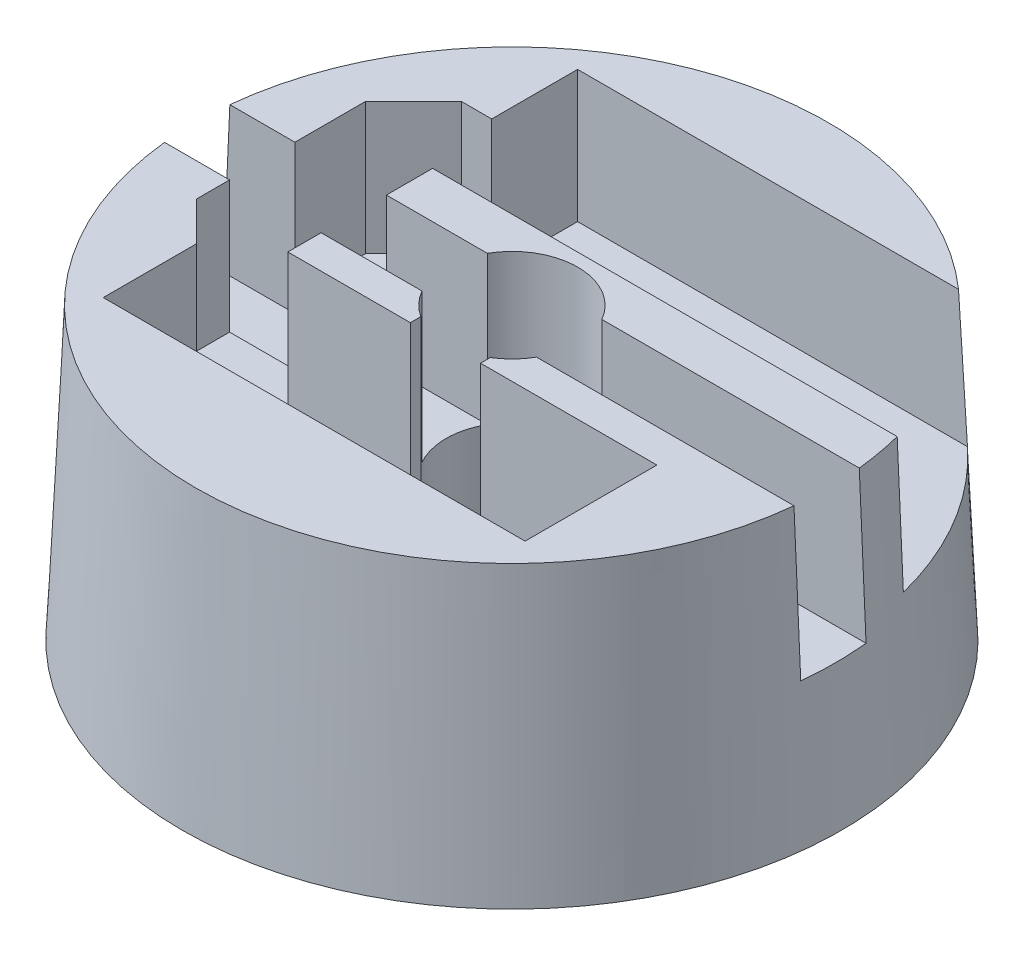
ISO-10303-21;
HEADER;
FILE_DESCRIPTION(('STEP AP214'),'2;1');
FILE_NAME('part.step','',(''),(''),'','','');
FILE_SCHEMA(('AUTOMOTIVE_DESIGN { 1 0 10303 214 1 1 1 1 }'));
ENDSEC;
DATA;
#1=APPLICATION_CONTEXT('core data for automotive mechanical design processes');
#2=APPLICATION_PROTOCOL_DEFINITION('international standard','automotive_design',2000,#1);
#3=PRODUCT_CONTEXT('',#1,'mechanical');
#4=PRODUCT('Part','Part','',(#3));
#5=PRODUCT_RELATED_PRODUCT_CATEGORY('part','',(#4));
#6=PRODUCT_DEFINITION_FORMATION('','',#4);
#7=PRODUCT_DEFINITION_CONTEXT('part definition',#1,'design');
#8=PRODUCT_DEFINITION('design','',#6,#7);
#9=PRODUCT_DEFINITION_SHAPE('','',#8);
#10=(LENGTH_UNIT() NAMED_UNIT(*) SI_UNIT(.MILLI.,.METRE.));
#11=(NAMED_UNIT(*) PLANE_ANGLE_UNIT() SI_UNIT($,.RADIAN.));
#12=(NAMED_UNIT(*) SI_UNIT($,.STERADIAN.) SOLID_ANGLE_UNIT());
#13=UNCERTAINTY_MEASURE_WITH_UNIT(LENGTH_MEASURE(1.E-05),#10,'distance_accuracy_value','');
#14=(GEOMETRIC_REPRESENTATION_CONTEXT(3) GLOBAL_UNCERTAINTY_ASSIGNED_CONTEXT((#13)) GLOBAL_UNIT_ASSIGNED_CONTEXT((#10,
#11,#12)) REPRESENTATION_CONTEXT('',''));
#15=CARTESIAN_POINT('',(0.,0.,0.));
#16=DIRECTION('',(0.,0.,1.));
#17=DIRECTION('',(1.,0.,0.));
#18=AXIS2_PLACEMENT_3D('',#15,#16,#17);
#19=CARTESIAN_POINT('',(0.,11.,0.));
#20=DIRECTION('',(0.,1.,0.));
#21=DIRECTION('',(0.,0.,1.));
#22=AXIS2_PLACEMENT_3D('',#19,#20,#21);
#23=PLANE('',#22);
#24=DIRECTION('',(0.,0.,-1.));
#25=VECTOR('',#24,1.);
#26=CARTESIAN_POINT('',(-5.99819685805333,11.,-2.99103256238981));
#27=LINE('',#26,#25);
#28=CARTESIAN_POINT('',(-5.99819685805333,11.,2.5));
#29=VERTEX_POINT('',#28);
#30=CARTESIAN_POINT('',(-5.99819685805333,11.,1.23834620696073));
#31=VERTEX_POINT('',#30);
#32=EDGE_CURVE('E257',#29,#31,#27,.T.);
#33=ORIENTED_EDGE('',*,*,#32,.F.);
#34=DIRECTION('',(1.,0.,0.));
#35=VECTOR('',#34,1.);
#36=CARTESIAN_POINT('',(0.,11.,2.5));
#37=LINE('',#36,#35);
#38=CARTESIAN_POINT('',(-1.35227256614182,11.,2.5));
#39=VERTEX_POINT('',#38);
#40=EDGE_CURVE('E487',#29,#39,#37,.T.);
#41=ORIENTED_EDGE('',*,*,#40,.T.);
#42=DIRECTION('',(0.,0.,1.));
#43=VECTOR('',#42,1.);
#44=CARTESIAN_POINT('',(-1.35227256614182,11.,0.));
#45=LINE('',#44,#43);
#46=CARTESIAN_POINT('',(-1.35227256614182,11.,2.10270276236567));
#47=VERTEX_POINT('',#46);
#48=EDGE_CURVE('E490',#47,#39,#45,.T.);
#49=ORIENTED_EDGE('',*,*,#48,.F.);
#50=CARTESIAN_POINT('',(0.,11.,0.));
#51=DIRECTION('',(0.,1.,0.));
#52=DIRECTION('',(0.,0.,1.));
#53=AXIS2_PLACEMENT_3D('',#50,#51,#52);
#54=CIRCLE('',#53,2.5);
#55=CARTESIAN_POINT('',(-2.17175014025693,11.,1.23834620696073));
#56=VERTEX_POINT('',#55);
#57=EDGE_CURVE('E499',#47,#56,#54,.F.);
#58=ORIENTED_EDGE('',*,*,#57,.T.);
#59=DIRECTION('',(1.,0.,0.));
#60=VECTOR('',#59,1.);
#61=CARTESIAN_POINT('',(0.,11.,1.23834620696073));
#62=LINE('',#61,#60);
#63=EDGE_CURVE('E544',#31,#56,#62,.T.);
#64=ORIENTED_EDGE('',*,*,#63,.F.);
#65=EDGE_LOOP('',(#33,#41,#49,#58,#64));
#66=FACE_BOUND('',#65,.T.);
#67=ADVANCED_FACE('F43',(#66),#23,.T.);
#68=CARTESIAN_POINT('',(-5.99819685805333,11.,-1.23834620696073));
#69=VERTEX_POINT('',#68);
#70=CARTESIAN_POINT('',(-5.99819685805333,11.,-2.99103256238981));
#71=VERTEX_POINT('',#70);
#72=EDGE_CURVE('E638',#69,#71,#27,.T.);
#73=ORIENTED_EDGE('',*,*,#72,.F.);
#74=DIRECTION('',(-1.,0.,0.));
#75=VECTOR('',#74,1.);
#76=CARTESIAN_POINT('',(0.,11.,-1.23834620696073));
#77=LINE('',#76,#75);
#78=CARTESIAN_POINT('',(-2.17175014025693,11.,-1.23834620696073));
#79=VERTEX_POINT('',#78);
#80=EDGE_CURVE('E566',#79,#69,#77,.T.);
#81=ORIENTED_EDGE('',*,*,#80,.F.);
#82=CARTESIAN_POINT('',(2.17175014025693,11.,-1.23834620696073));
#83=VERTEX_POINT('',#82);
#84=EDGE_CURVE('E497',#79,#83,#54,.F.);
#85=ORIENTED_EDGE('',*,*,#84,.T.);
#86=CARTESIAN_POINT('',(11.9359351916848,11.,-1.23834620696073));
#87=VERTEX_POINT('',#86);
#88=EDGE_CURVE('E557',#87,#83,#77,.T.);
#89=ORIENTED_EDGE('',*,*,#88,.F.);
#90=CARTESIAN_POINT('',(0.,11.,0.));
#91=DIRECTION('',(0.,1.,0.));
#92=DIRECTION('',(0.,0.,1.));
#93=AXIS2_PLACEMENT_3D('',#90,#91,#92);
#94=CIRCLE('',#93,12.);
#95=CARTESIAN_POINT('',(11.6212617305835,11.,-2.99103256238982));
#96=VERTEX_POINT('',#95);
#97=EDGE_CURVE('E353',#87,#96,#94,.T.);
#98=ORIENTED_EDGE('',*,*,#97,.T.);
#99=DIRECTION('',(-1.,0.,0.));
#100=VECTOR('',#99,1.);
#101=CARTESIAN_POINT('',(0.,11.,-2.99103256238981));
#102=LINE('',#101,#100);
#103=EDGE_CURVE('E274',#96,#71,#102,.T.);
#104=ORIENTED_EDGE('',*,*,#103,.T.);
#105=EDGE_LOOP('',(#73,#81,#85,#89,#98,#104));
#106=FACE_BOUND('',#105,.T.);
#107=ADVANCED_FACE('F676',(#106),#23,.T.);
#108=DIRECTION('',(0.707106781186557,0.,0.707106781186538));
#109=VECTOR('',#108,1.);
#110=CARTESIAN_POINT('',(-8.,11.,3.96939497959408));
#111=LINE('',#110,#109);
#112=CARTESIAN_POINT('',(-9.46939497959411,11.,2.5));
#113=VERTEX_POINT('',#112);
#114=CARTESIAN_POINT('',(-8.,11.,3.96939497959408));
#115=VERTEX_POINT('',#114);
#116=EDGE_CURVE('E641',#113,#115,#111,.T.);
#117=ORIENTED_EDGE('',*,*,#116,.F.);
#118=DIRECTION('',(0.,0.,1.));
#119=VECTOR('',#118,1.);
#120=CARTESIAN_POINT('',(-9.46939497959411,11.,2.5));
#121=LINE('',#120,#119);
#122=CARTESIAN_POINT('',(-9.46939497959411,11.,1.23834620696073));
#123=VERTEX_POINT('',#122);
#124=EDGE_CURVE('E647',#123,#113,#121,.T.);
#125=ORIENTED_EDGE('',*,*,#124,.F.);
#126=CARTESIAN_POINT('',(-11.9359351916849,11.,1.23834620696073));
#127=VERTEX_POINT('',#126);
#128=EDGE_CURVE('E282',#127,#123,#62,.T.);
#129=ORIENTED_EDGE('',*,*,#128,.F.);
#130=CARTESIAN_POINT('',(11.9359311362898,11.,1.23834620696073));
#131=VERTEX_POINT('',#130);
#132=EDGE_CURVE('E462',#127,#131,#94,.T.);
#133=ORIENTED_EDGE('',*,*,#132,.T.);
#134=CARTESIAN_POINT('',(2.17175014025693,11.,1.23834620696073));
#135=VERTEX_POINT('',#134);
#136=EDGE_CURVE('E548',#135,#131,#62,.T.);
#137=ORIENTED_EDGE('',*,*,#136,.F.);
#138=CARTESIAN_POINT('',(1.30993148311024,11.,2.12933781010826));
#139=VERTEX_POINT('',#138);
#140=EDGE_CURVE('E494',#135,#139,#54,.F.);
#141=ORIENTED_EDGE('',*,*,#140,.T.);
#142=DIRECTION('',(0.,0.,1.));
#143=VECTOR('',#142,1.);
#144=CARTESIAN_POINT('',(1.30993148311024,11.,0.));
#145=LINE('',#144,#143);
#146=CARTESIAN_POINT('',(1.30993148311024,11.,2.5));
#147=VERTEX_POINT('',#146);
#148=EDGE_CURVE('E504',#139,#147,#145,.T.);
#149=ORIENTED_EDGE('',*,*,#148,.T.);
#150=DIRECTION('',(1.,0.,0.));
#151=VECTOR('',#150,1.);
#152=CARTESIAN_POINT('',(0.,11.,2.5));
#153=LINE('',#152,#151);
#154=CARTESIAN_POINT('',(8.,11.,2.5));
#155=VERTEX_POINT('',#154);
#156=EDGE_CURVE('E473',#147,#155,#153,.T.);
#157=ORIENTED_EDGE('',*,*,#156,.T.);
#158=DIRECTION('',(0.,0.,1.));
#159=VECTOR('',#158,1.);
#160=CARTESIAN_POINT('',(8.,11.,0.));
#161=LINE('',#160,#159);
#162=CARTESIAN_POINT('',(8.,11.,7.5));
#163=VERTEX_POINT('',#162);
#164=EDGE_CURVE('E477',#155,#163,#161,.T.);
#165=ORIENTED_EDGE('',*,*,#164,.T.);
#166=DIRECTION('',(1.,0.,0.));
#167=VECTOR('',#166,1.);
#168=CARTESIAN_POINT('',(0.,11.,7.5));
#169=LINE('',#168,#167);
#170=CARTESIAN_POINT('',(-8.,11.,7.5));
#171=VERTEX_POINT('',#170);
#172=EDGE_CURVE('E481',#171,#163,#169,.T.);
#173=ORIENTED_EDGE('',*,*,#172,.F.);
#174=DIRECTION('',(0.,0.,1.));
#175=VECTOR('',#174,1.);
#176=CARTESIAN_POINT('',(-8.,11.,0.));
#177=LINE('',#176,#175);
#178=EDGE_CURVE('E484',#115,#171,#177,.T.);
#179=ORIENTED_EDGE('',*,*,#178,.F.);
#180=EDGE_LOOP('',(#117,#125,#129,#133,#137,#141,#149,#157,#165,#173,#179));
#181=FACE_BOUND('',#180,.T.);
#182=ADVANCED_FACE('F698',(#181),#23,.T.);
#183=CARTESIAN_POINT('',(0.,0.,0.));
#184=DIRECTION('',(0.,1.,0.));
#185=DIRECTION('',(0.,0.,1.));
#186=AXIS2_PLACEMENT_3D('',#183,#184,#185);
#187=PLANE('',#186);
#188=CARTESIAN_POINT('',(0.,0.,0.));
#189=DIRECTION('',(0.,1.,0.));
#190=DIRECTION('',(0.,0.,1.));
#191=AXIS2_PLACEMENT_3D('',#188,#189,#190);
#192=CIRCLE('',#191,12.5);
#193=CARTESIAN_POINT('',(0.,0.,12.5));
#194=VERTEX_POINT('',#193);
#195=EDGE_CURVE('E470',#194,#194,#192,.T.);
#196=ORIENTED_EDGE('',*,*,#195,.F.);
#197=EDGE_LOOP('',(#196));
#198=FACE_BOUND('',#197,.T.);
#199=DIRECTION('',(0.,0.,-1.));
#200=VECTOR('',#199,1.);
#201=CARTESIAN_POINT('',(1.30993148311024,0.,2.5));
#202=LINE('',#201,#200);
#203=CARTESIAN_POINT('',(1.30993148311024,0.,2.5));
#204=VERTEX_POINT('',#203);
#205=CARTESIAN_POINT('',(1.30993148311024,0.,2.12933781010826));
#206=VERTEX_POINT('',#205);
#207=EDGE_CURVE('E296',#204,#206,#202,.T.);
#208=ORIENTED_EDGE('',*,*,#207,.T.);
#209=CARTESIAN_POINT('',(0.,0.,0.));
#210=DIRECTION('',(0.,1.,0.));
#211=DIRECTION('',(0.,0.,1.));
#212=AXIS2_PLACEMENT_3D('',#209,#210,#211);
#213=CIRCLE('',#212,2.5);
#214=CARTESIAN_POINT('',(-1.35227256614182,0.,2.10270276236567));
#215=VERTEX_POINT('',#214);
#216=EDGE_CURVE('E300',#206,#215,#213,.T.);
#217=ORIENTED_EDGE('',*,*,#216,.T.);
#218=DIRECTION('',(0.,0.,-1.));
#219=VECTOR('',#218,1.);
#220=CARTESIAN_POINT('',(-1.35227256614182,0.,2.5));
#221=LINE('',#220,#219);
#222=CARTESIAN_POINT('',(-1.35227256614182,0.,2.5));
#223=VERTEX_POINT('',#222);
#224=EDGE_CURVE('E304',#223,#215,#221,.T.);
#225=ORIENTED_EDGE('',*,*,#224,.F.);
#226=DIRECTION('',(-1.,0.,0.));
#227=VECTOR('',#226,1.);
#228=CARTESIAN_POINT('',(-1.35227256614182,0.,2.5));
#229=LINE('',#228,#227);
#230=CARTESIAN_POINT('',(-8.,0.,2.5));
#231=VERTEX_POINT('',#230);
#232=EDGE_CURVE('E308',#223,#231,#229,.T.);
#233=ORIENTED_EDGE('',*,*,#232,.T.);
#234=DIRECTION('',(0.,0.,-1.));
#235=VECTOR('',#234,1.);
#236=CARTESIAN_POINT('',(-8.,0.,7.5));
#237=LINE('',#236,#235);
#238=CARTESIAN_POINT('',(-8.,0.,7.5));
#239=VERTEX_POINT('',#238);
#240=EDGE_CURVE('E312',#239,#231,#237,.T.);
#241=ORIENTED_EDGE('',*,*,#240,.F.);
#242=DIRECTION('',(-1.,0.,0.));
#243=VECTOR('',#242,1.);
#244=CARTESIAN_POINT('',(8.,0.,7.5));
#245=LINE('',#244,#243);
#246=CARTESIAN_POINT('',(8.,0.,7.5));
#247=VERTEX_POINT('',#246);
#248=EDGE_CURVE('E316',#247,#239,#245,.T.);
#249=ORIENTED_EDGE('',*,*,#248,.F.);
#250=DIRECTION('',(0.,0.,-1.));
#251=VECTOR('',#250,1.);
#252=CARTESIAN_POINT('',(8.,0.,7.5));
#253=LINE('',#252,#251);
#254=CARTESIAN_POINT('',(8.,0.,2.5));
#255=VERTEX_POINT('',#254);
#256=EDGE_CURVE('E320',#247,#255,#253,.T.);
#257=ORIENTED_EDGE('',*,*,#256,.T.);
#258=DIRECTION('',(-1.,0.,0.));
#259=VECTOR('',#258,1.);
#260=CARTESIAN_POINT('',(8.,0.,2.5));
#261=LINE('',#260,#259);
#262=EDGE_CURVE('E324',#255,#204,#261,.T.);
#263=ORIENTED_EDGE('',*,*,#262,.T.);
#264=EDGE_LOOP('',(#208,#217,#225,#233,#241,#249,#257,#263));
#265=FACE_BOUND('',#264,.T.);
#266=ADVANCED_FACE('F45',(#198,#265),#187,.F.);
#267=CARTESIAN_POINT('',(-9.46939497959411,11.,-3.91058912804461));
#268=VERTEX_POINT('',#267);
#269=CARTESIAN_POINT('',(-9.46939497959411,11.,-1.23834620696073));
#270=VERTEX_POINT('',#269);
#271=EDGE_CURVE('E644',#268,#270,#121,.T.);
#272=ORIENTED_EDGE('',*,*,#271,.F.);
#273=DIRECTION('',(-0.707106781186538,0.,0.707106781186557));
#274=VECTOR('',#273,1.);
#275=CARTESIAN_POINT('',(-9.46939497959411,11.,-3.91058912804461));
#276=LINE('',#275,#274);
#277=CARTESIAN_POINT('',(-7.64558714149943,11.,-5.73439696613935));
#278=VERTEX_POINT('',#277);
#279=EDGE_CURVE('E266',#278,#268,#276,.T.);
#280=ORIENTED_EDGE('',*,*,#279,.F.);
#281=DIRECTION('',(-1.,0.,0.));
#282=VECTOR('',#281,1.);
#283=CARTESIAN_POINT('',(-7.64558714149943,11.,-5.73439696613935));
#284=LINE('',#283,#282);
#285=CARTESIAN_POINT('',(-6.5,11.,-5.73439696613935));
#286=VERTEX_POINT('',#285);
#287=EDGE_CURVE('E248',#286,#278,#284,.T.);
#288=ORIENTED_EDGE('',*,*,#287,.F.);
#289=DIRECTION('',(0.,0.,-1.));
#290=VECTOR('',#289,1.);
#291=CARTESIAN_POINT('',(-6.5,11.,0.));
#292=LINE('',#291,#290);
#293=CARTESIAN_POINT('',(-6.5,11.,-8.99103256238981));
#294=VERTEX_POINT('',#293);
#295=EDGE_CURVE('E263',#286,#294,#292,.T.);
#296=ORIENTED_EDGE('',*,*,#295,.T.);
#297=DIRECTION('',(-1.,0.,0.));
#298=VECTOR('',#297,1.);
#299=CARTESIAN_POINT('',(0.,11.,-8.99103256238981));
#300=LINE('',#299,#298);
#301=CARTESIAN_POINT('',(7.94741048782848,11.,-8.99103256238982));
#302=VERTEX_POINT('',#301);
#303=EDGE_CURVE('E280',#302,#294,#300,.T.);
#304=ORIENTED_EDGE('',*,*,#303,.F.);
#305=CARTESIAN_POINT('',(-11.9359311362898,11.,-1.23834620696073));
#306=VERTEX_POINT('',#305);
#307=EDGE_CURVE('E466',#302,#306,#94,.T.);
#308=ORIENTED_EDGE('',*,*,#307,.T.);
#309=EDGE_CURVE('E48',#270,#306,#77,.T.);
#310=ORIENTED_EDGE('',*,*,#309,.F.);
#311=EDGE_LOOP('',(#272,#280,#288,#296,#304,#308,#310));
#312=FACE_BOUND('',#311,.T.);
#313=ADVANCED_FACE('F261',(#312),#23,.T.);
#314=CARTESIAN_POINT('',(0.,11.,0.));
#315=DIRECTION('',(0.,-1.,0.));
#316=DIRECTION('',(0.,0.,-1.));
#317=AXIS2_PLACEMENT_3D('',#314,#315,#316);
#318=CONICAL_SURFACE('',#317,12.,0.0454232794215769);
#319=CARTESIAN_POINT('',(-13.117029772466,-14.8578033242267,1.23834620696073));
#320=CARTESIAN_POINT('',(-12.7644742884908,-7.13534234058265,1.23834620696073));
#321=CARTESIAN_POINT('',(-12.4117562562751,0.587111215347854,1.23834620696073));
#322=CARTESIAN_POINT('',(-11.7059950953354,16.0320034723826,1.23834620696073));
#323=CARTESIAN_POINT('',(-11.3529519666113,23.7544421734868,1.23834620696073));
#324=CARTESIAN_POINT('',(-10.9997462896468,31.4768734468775,1.23834620696073));
#325=B_SPLINE_CURVE_WITH_KNOTS('',3,(#319,#320,#321,#322,#323,#324),.UNSPECIFIED.,.F.,.F.,(4,2,
4),(0.,23.1915133271588,46.3830266561217),.UNSPECIFIED.);
#326=CARTESIAN_POINT('',(-12.193052592803,5.37293922191145,1.23834620696073));
#327=VERTEX_POINT('',#326);
#328=EDGE_CURVE('E275',#327,#127,#325,.T.);
#329=ORIENTED_EDGE('',*,*,#328,.F.);
#330=CARTESIAN_POINT('',(0.,5.37293922191145,0.));
#331=DIRECTION('',(0.,-1.,0.));
#332=DIRECTION('',(0.,0.,-1.));
#333=AXIS2_PLACEMENT_3D('',#330,#331,#332);
#334=CIRCLE('',#333,12.2557754899131);
#335=CARTESIAN_POINT('',(-12.193052592803,5.37293922191145,-1.23834620696073));
#336=VERTEX_POINT('',#335);
#337=EDGE_CURVE('E580',#336,#327,#334,.F.);
#338=ORIENTED_EDGE('',*,*,#337,.F.);
#339=CARTESIAN_POINT('',(-10.9997462896468,31.4768734468775,-1.23834620696073));
#340=CARTESIAN_POINT('',(-11.3529519666113,23.7544421734868,-1.23834620696073));
#341=CARTESIAN_POINT('',(-11.7059950953354,16.0320034723826,-1.23834620696073));
#342=CARTESIAN_POINT('',(-12.4117562562751,0.587111215347852,-1.23834620696073));
#343=CARTESIAN_POINT('',(-12.7644742884908,-7.13534234058266,-1.23834620696073));
#344=CARTESIAN_POINT('',(-13.117029772466,-14.8578033242267,-1.23834620696073));
#345=B_SPLINE_CURVE_WITH_KNOTS('',3,(#339,#340,#341,#342,#343,#344),.UNSPECIFIED.,.F.,.F.,(4,2,
4),(0.,23.1915133289628,46.3830266561217),.UNSPECIFIED.);
#346=EDGE_CURVE('E563',#306,#336,#345,.T.);
#347=ORIENTED_EDGE('',*,*,#346,.F.);
#348=ORIENTED_EDGE('',*,*,#307,.F.);
#349=CARTESIAN_POINT('',(9.62456027674111,-14.7583135931586,-8.99103256238982));
#350=CARTESIAN_POINT('',(9.50460311291744,-12.8298920917526,-8.99103256238982));
#351=CARTESIAN_POINT('',(9.38361471344495,-10.9015350060955,-8.99103256238982));
#352=CARTESIAN_POINT('',(9.13929785485715,-7.04496844380558,-8.99103256238982));
#353=CARTESIAN_POINT('',(9.0159693949052,-5.11675896722578,-8.99103256238982));
#354=CARTESIAN_POINT('',(8.64206128999401,0.66756183088233,-8.99103256238982));
#355=CARTESIAN_POINT('',(8.38755545312266,4.52342151389375,-8.99103256238982));
#356=CARTESIAN_POINT('',(7.99550974336136,10.3065291788593,-8.99103256238982));
#357=CARTESIAN_POINT('',(7.86311276847584,12.2341262068182,-8.99103256238982));
#358=CARTESIAN_POINT('',(7.59431080439872,16.0890398542785,-8.99103256238982));
#359=CARTESIAN_POINT('',(7.45790581810993,18.0163564739822,-8.99103256238982));
#360=CARTESIAN_POINT('',(7.18040413035396,21.8706799581701,-8.99103256238982));
#361=CARTESIAN_POINT('',(7.03930736354176,23.7976868179642,-8.99103256238982));
#362=CARTESIAN_POINT('',(6.75144536837912,27.6512815916487,-8.99103256238982));
#363=CARTESIAN_POINT('',(6.60468012549323,29.577869504452,-8.99103256238982));
#364=CARTESIAN_POINT('',(6.45459172817763,31.5042018369519,-8.99103256238982));
#365=B_SPLINE_CURVE_WITH_KNOTS('',3,(#349,#350,#351,#352,#353,#354,#355,#356,#357,#358,#359,
#360,#361,#362,#363,#364),.UNSPECIFIED.,.F.,.F.,(4,2,2,2,2,2,2,4),(0.,5.79644557675369,
11.5928932258963,23.1856202235854,28.9820325433494,34.7784406651606,40.5749295505959,
46.3714333007276),.UNSPECIFIED.);
#366=CARTESIAN_POINT('',(8.28658746464149,6.,-8.99103256238982));
#367=VERTEX_POINT('',#366);
#368=EDGE_CURVE('E515',#367,#302,#365,.T.);
#369=ORIENTED_EDGE('',*,*,#368,.F.);
#370=CARTESIAN_POINT('',(0.,6.,0.));
#371=DIRECTION('',(0.,1.,0.));
#372=DIRECTION('',(0.,0.,1.));
#373=AXIS2_PLACEMENT_3D('',#370,#371,#372);
#374=CIRCLE('',#373,12.2272727272727);
#375=CARTESIAN_POINT('',(11.8557970022193,6.,-2.99103256238982));
#376=VERTEX_POINT('',#375);
#377=EDGE_CURVE('E507',#367,#376,#374,.F.);
#378=ORIENTED_EDGE('',*,*,#377,.T.);
#379=CARTESIAN_POINT('',(12.81776976363,-14.5667190671401,-2.99103256238982));
#380=CARTESIAN_POINT('',(12.6377312094468,-10.7095320178803,-2.99103256238982));
#381=CARTESIAN_POINT('',(12.4575004855776,-6.85235393167699,-2.99103256238982));
#382=CARTESIAN_POINT('',(12.0965933018263,0.861981317465294,-2.99103256238982));
#383=CARTESIAN_POINT('',(11.9159168419521,4.71913848040464,-2.99103256238982));
#384=CARTESIAN_POINT('',(11.5540567823311,12.4334290405398,-2.99103256238982));
#385=CARTESIAN_POINT('',(11.3728731825819,16.2905624377355,-2.99103256238982));
#386=CARTESIAN_POINT('',(11.0099173026102,24.0048016014442,-2.99103256238982));
#387=CARTESIAN_POINT('',(10.8281450223771,27.8619073679565,-2.99103256238982));
#388=CARTESIAN_POINT('',(10.6460376344222,31.7189973266309,-2.99103256238982));
#389=B_SPLINE_CURVE_WITH_KNOTS('',3,(#379,#380,#381,#382,#383,#384,#385,#386,#387,#388),
.UNSPECIFIED.,.F.,.F.,(4,2,2,2,4),(0.,11.5841595480429,23.1683188899669,34.7524782841745,
46.3366378848027),.UNSPECIFIED.);
#390=EDGE_CURVE('E511',#376,#96,#389,.T.);
#391=ORIENTED_EDGE('',*,*,#390,.T.);
#392=ORIENTED_EDGE('',*,*,#97,.F.);
#393=CARTESIAN_POINT('',(13.117029772466,-14.8578033242267,-1.23834620696073));
#394=CARTESIAN_POINT('',(12.7644742884908,-7.13534234058265,-1.23834620696073));
#395=CARTESIAN_POINT('',(12.4117562562751,0.587111215347854,-1.23834620696073));
#396=CARTESIAN_POINT('',(11.7059950953354,16.0320034723826,-1.23834620696073));
#397=CARTESIAN_POINT('',(11.3529519666113,23.7544421734868,-1.23834620696073));
#398=CARTESIAN_POINT('',(10.9997462896468,31.4768734468775,-1.23834620696073));
#399=B_SPLINE_CURVE_WITH_KNOTS('',3,(#393,#394,#395,#396,#397,#398),.UNSPECIFIED.,.F.,.F.,(4,2,
4),(0.,23.1915133271588,46.3830266561217),.UNSPECIFIED.);
#400=CARTESIAN_POINT('',(12.193052592803,5.37293922191145,-1.23834620696073));
#401=VERTEX_POINT('',#400);
#402=EDGE_CURVE('E552',#401,#87,#399,.T.);
#403=ORIENTED_EDGE('',*,*,#402,.F.);
#404=CARTESIAN_POINT('',(12.193052592803,5.37293922191145,1.23834620696073));
#405=VERTEX_POINT('',#404);
#406=EDGE_CURVE('E584',#405,#401,#334,.F.);
#407=ORIENTED_EDGE('',*,*,#406,.F.);
#408=CARTESIAN_POINT('',(10.9997462896468,31.4768734468775,1.23834620696073));
#409=CARTESIAN_POINT('',(11.3529519666113,23.7544421734868,1.23834620696073));
#410=CARTESIAN_POINT('',(11.7059950953354,16.0320034723826,1.23834620696073));
#411=CARTESIAN_POINT('',(12.4117562562751,0.587111215347852,1.23834620696073));
#412=CARTESIAN_POINT('',(12.7644742884908,-7.13534234058266,1.23834620696073));
#413=CARTESIAN_POINT('',(13.117029772466,-14.8578033242267,1.23834620696073));
#414=B_SPLINE_CURVE_WITH_KNOTS('',3,(#408,#409,#410,#411,#412,#413),.UNSPECIFIED.,.F.,.F.,(4,2,
4),(0.,23.1915133289628,46.3830266561217),.UNSPECIFIED.);
#415=EDGE_CURVE('E429',#131,#405,#414,.T.);
#416=ORIENTED_EDGE('',*,*,#415,.F.);
#417=ORIENTED_EDGE('',*,*,#132,.F.);
#418=EDGE_LOOP('',(#329,#338,#347,#348,#369,#378,#391,#392,#403,#407,#416,#417));
#419=FACE_BOUND('',#418,.T.);
#420=ORIENTED_EDGE('',*,*,#195,.T.);
#421=EDGE_LOOP('',(#420));
#422=FACE_BOUND('',#421,.T.);
#423=ADVANCED_FACE('F362',(#419,#422),#318,.T.);
#424=CARTESIAN_POINT('',(1.30993148311024,11.0001,2.5));
#425=DIRECTION('',(-1.,0.,0.));
#426=DIRECTION('',(0.,0.,1.));
#427=AXIS2_PLACEMENT_3D('',#424,#425,#426);
#428=PLANE('',#427);
#429=DIRECTION('',(0.,-1.,0.));
#430=VECTOR('',#429,1.);
#431=CARTESIAN_POINT('',(1.30993148311024,11.0001,2.12933781010826));
#432=LINE('',#431,#430);
#433=EDGE_CURVE('E350',#139,#206,#432,.T.);
#434=ORIENTED_EDGE('',*,*,#433,.T.);
#435=ORIENTED_EDGE('',*,*,#207,.F.);
#436=DIRECTION('',(0.,-1.,0.));
#437=VECTOR('',#436,1.);
#438=CARTESIAN_POINT('',(1.30993148311024,11.0001,2.5));
#439=LINE('',#438,#437);
#440=EDGE_CURVE('E328',#147,#204,#439,.T.);
#441=ORIENTED_EDGE('',*,*,#440,.F.);
#442=ORIENTED_EDGE('',*,*,#148,.F.);
#443=EDGE_LOOP('',(#434,#435,#441,#442));
#444=FACE_BOUND('',#443,.T.);
#445=ADVANCED_FACE('F371',(#444),#428,.T.);
#446=CARTESIAN_POINT('',(0.,11.0001,0.));
#447=DIRECTION('',(0.,-1.,0.));
#448=DIRECTION('',(0.,0.,-1.));
#449=AXIS2_PLACEMENT_3D('',#446,#447,#448);
#450=CYLINDRICAL_SURFACE('',#449,2.5);
#451=DIRECTION('',(0.,-1.,0.));
#452=VECTOR('',#451,1.);
#453=CARTESIAN_POINT('',(2.17175014025693,11.0001,1.23834620696073));
#454=LINE('',#453,#452);
#455=CARTESIAN_POINT('',(2.17175014025693,5.37293922191145,1.23834620696073));
#456=VERTEX_POINT('',#455);
#457=EDGE_CURVE('E531',#456,#135,#454,.F.);
#458=ORIENTED_EDGE('',*,*,#457,.F.);
#459=CARTESIAN_POINT('',(0.,5.37293922191145,0.));
#460=DIRECTION('',(0.,-1.,0.));
#461=DIRECTION('',(0.,0.,-1.));
#462=AXIS2_PLACEMENT_3D('',#459,#460,#461);
#463=CIRCLE('',#462,2.5);
#464=CARTESIAN_POINT('',(2.17175014025693,5.37293922191145,-1.23834620696073));
#465=VERTEX_POINT('',#464);
#466=EDGE_CURVE('E520',#465,#456,#463,.T.);
#467=ORIENTED_EDGE('',*,*,#466,.F.);
#468=DIRECTION('',(0.,-1.,0.));
#469=VECTOR('',#468,1.);
#470=CARTESIAN_POINT('',(2.17175014025693,11.0001,-1.23834620696073));
#471=LINE('',#470,#469);
#472=EDGE_CURVE('E528',#83,#465,#471,.T.);
#473=ORIENTED_EDGE('',*,*,#472,.F.);
#474=ORIENTED_EDGE('',*,*,#84,.F.);
#475=DIRECTION('',(0.,-1.,0.));
#476=VECTOR('',#475,1.);
#477=CARTESIAN_POINT('',(-2.17175014025693,11.0001,-1.23834620696073));
#478=LINE('',#477,#476);
#479=CARTESIAN_POINT('',(-2.17175014025693,5.37293922191145,-1.23834620696073));
#480=VERTEX_POINT('',#479);
#481=EDGE_CURVE('E519',#480,#79,#478,.F.);
#482=ORIENTED_EDGE('',*,*,#481,.F.);
#483=CARTESIAN_POINT('',(-2.17175014025693,5.37293922191145,1.23834620696073));
#484=VERTEX_POINT('',#483);
#485=EDGE_CURVE('E517',#484,#480,#463,.T.);
#486=ORIENTED_EDGE('',*,*,#485,.F.);
#487=DIRECTION('',(0.,-1.,0.));
#488=VECTOR('',#487,1.);
#489=CARTESIAN_POINT('',(-2.17175014025693,11.0001,1.23834620696073));
#490=LINE('',#489,#488);
#491=EDGE_CURVE('E522',#56,#484,#490,.T.);
#492=ORIENTED_EDGE('',*,*,#491,.F.);
#493=ORIENTED_EDGE('',*,*,#57,.F.);
#494=DIRECTION('',(0.,-1.,0.));
#495=VECTOR('',#494,1.);
#496=CARTESIAN_POINT('',(-1.35227256614182,11.0001,2.10270276236567));
#497=LINE('',#496,#495);
#498=EDGE_CURVE('E347',#47,#215,#497,.T.);
#499=ORIENTED_EDGE('',*,*,#498,.T.);
#500=ORIENTED_EDGE('',*,*,#216,.F.);
#501=ORIENTED_EDGE('',*,*,#433,.F.);
#502=ORIENTED_EDGE('',*,*,#140,.F.);
#503=EDGE_LOOP('',(#458,#467,#473,#474,#482,#486,#492,#493,#499,#500,#501,#502));
#504=FACE_BOUND('',#503,.T.);
#505=ADVANCED_FACE('F710',(#504),#450,.F.);
#506=CARTESIAN_POINT('',(-1.35227256614182,11.0001,2.5));
#507=DIRECTION('',(-1.,0.,0.));
#508=DIRECTION('',(0.,0.,1.));
#509=AXIS2_PLACEMENT_3D('',#506,#507,#508);
#510=PLANE('',#509);
#511=ORIENTED_EDGE('',*,*,#48,.T.);
#512=DIRECTION('',(0.,-1.,0.));
#513=VECTOR('',#512,1.);
#514=CARTESIAN_POINT('',(-1.35227256614182,11.0001,2.5));
#515=LINE('',#514,#513);
#516=EDGE_CURVE('E344',#39,#223,#515,.T.);
#517=ORIENTED_EDGE('',*,*,#516,.T.);
#518=ORIENTED_EDGE('',*,*,#224,.T.);
#519=ORIENTED_EDGE('',*,*,#498,.F.);
#520=EDGE_LOOP('',(#511,#517,#518,#519));
#521=FACE_BOUND('',#520,.T.);
#522=ADVANCED_FACE('F764',(#521),#510,.F.);
#523=CARTESIAN_POINT('',(-1.35227256614182,11.0001,2.5));
#524=DIRECTION('',(0.,0.,1.));
#525=DIRECTION('',(1.,0.,0.));
#526=AXIS2_PLACEMENT_3D('',#523,#524,#525);
#527=PLANE('',#526);
#528=DIRECTION('',(0.,1.,0.));
#529=VECTOR('',#528,1.);
#530=CARTESIAN_POINT('',(-5.99819685805333,11.0001,2.5));
#531=LINE('',#530,#529);
#532=CARTESIAN_POINT('',(-5.99819685805333,6.,2.5));
#533=VERTEX_POINT('',#532);
#534=EDGE_CURVE('E596',#533,#29,#531,.T.);
#535=ORIENTED_EDGE('',*,*,#534,.F.);
#536=DIRECTION('',(-1.,0.,0.));
#537=VECTOR('',#536,1.);
#538=CARTESIAN_POINT('',(-1.35227256614182,6.,2.5));
#539=LINE('',#538,#537);
#540=CARTESIAN_POINT('',(-8.,6.,2.5));
#541=VERTEX_POINT('',#540);
#542=EDGE_CURVE('E608',#533,#541,#539,.T.);
#543=ORIENTED_EDGE('',*,*,#542,.T.);
#544=DIRECTION('',(0.,-1.,0.));
#545=VECTOR('',#544,1.);
#546=CARTESIAN_POINT('',(-8.,11.0001,2.5));
#547=LINE('',#546,#545);
#548=EDGE_CURVE('E341',#541,#231,#547,.T.);
#549=ORIENTED_EDGE('',*,*,#548,.T.);
#550=ORIENTED_EDGE('',*,*,#232,.F.);
#551=ORIENTED_EDGE('',*,*,#516,.F.);
#552=ORIENTED_EDGE('',*,*,#40,.F.);
#553=EDGE_LOOP('',(#535,#543,#549,#550,#551,#552));
#554=FACE_BOUND('',#553,.T.);
#555=ADVANCED_FACE('F756',(#554),#527,.T.);
#556=CARTESIAN_POINT('',(-8.,11.0001,7.5));
#557=DIRECTION('',(-1.,0.,0.));
#558=DIRECTION('',(0.,0.,1.));
#559=AXIS2_PLACEMENT_3D('',#556,#557,#558);
#560=PLANE('',#559);
#561=DIRECTION('',(0.,0.,-1.));
#562=VECTOR('',#561,1.);
#563=CARTESIAN_POINT('',(-8.,6.,7.5));
#564=LINE('',#563,#562);
#565=CARTESIAN_POINT('',(-8.,6.,3.96939497959408));
#566=VERTEX_POINT('',#565);
#567=EDGE_CURVE('E612',#566,#541,#564,.T.);
#568=ORIENTED_EDGE('',*,*,#567,.F.);
#569=DIRECTION('',(0.,1.,0.));
#570=VECTOR('',#569,1.);
#571=CARTESIAN_POINT('',(-8.,-4.3059591754028,3.96939497959408));
#572=LINE('',#571,#570);
#573=EDGE_CURVE('E630',#566,#115,#572,.T.);
#574=ORIENTED_EDGE('',*,*,#573,.T.);
#575=ORIENTED_EDGE('',*,*,#178,.T.);
#576=DIRECTION('',(0.,-1.,0.));
#577=VECTOR('',#576,1.);
#578=CARTESIAN_POINT('',(-8.,11.0001,7.5));
#579=LINE('',#578,#577);
#580=EDGE_CURVE('E338',#171,#239,#579,.T.);
#581=ORIENTED_EDGE('',*,*,#580,.T.);
#582=ORIENTED_EDGE('',*,*,#240,.T.);
#583=ORIENTED_EDGE('',*,*,#548,.F.);
#584=EDGE_LOOP('',(#568,#574,#575,#581,#582,#583));
#585=FACE_BOUND('',#584,.T.);
#586=ADVANCED_FACE('F735',(#585),#560,.F.);
#587=CARTESIAN_POINT('',(8.,11.0001,7.5));
#588=DIRECTION('',(0.,0.,1.));
#589=DIRECTION('',(1.,0.,0.));
#590=AXIS2_PLACEMENT_3D('',#587,#588,#589);
#591=PLANE('',#590);
#592=ORIENTED_EDGE('',*,*,#172,.T.);
#593=DIRECTION('',(0.,-1.,0.));
#594=VECTOR('',#593,1.);
#595=CARTESIAN_POINT('',(8.,11.0001,7.5));
#596=LINE('',#595,#594);
#597=EDGE_CURVE('E335',#163,#247,#596,.T.);
#598=ORIENTED_EDGE('',*,*,#597,.T.);
#599=ORIENTED_EDGE('',*,*,#248,.T.);
#600=ORIENTED_EDGE('',*,*,#580,.F.);
#601=EDGE_LOOP('',(#592,#598,#599,#600));
#602=FACE_BOUND('',#601,.T.);
#603=ADVANCED_FACE('F732',(#602),#591,.F.);
#604=CARTESIAN_POINT('',(8.,11.0001,7.5));
#605=DIRECTION('',(-1.,0.,0.));
#606=DIRECTION('',(0.,0.,1.));
#607=AXIS2_PLACEMENT_3D('',#604,#605,#606);
#608=PLANE('',#607);
#609=DIRECTION('',(0.,-1.,0.));
#610=VECTOR('',#609,1.);
#611=CARTESIAN_POINT('',(8.,11.0001,2.5));
#612=LINE('',#611,#610);
#613=EDGE_CURVE('E332',#155,#255,#612,.T.);
#614=ORIENTED_EDGE('',*,*,#613,.T.);
#615=ORIENTED_EDGE('',*,*,#256,.F.);
#616=ORIENTED_EDGE('',*,*,#597,.F.);
#617=ORIENTED_EDGE('',*,*,#164,.F.);
#618=EDGE_LOOP('',(#614,#615,#616,#617));
#619=FACE_BOUND('',#618,.T.);
#620=ADVANCED_FACE('F726',(#619),#608,.T.);
#621=CARTESIAN_POINT('',(8.,11.0001,2.5));
#622=DIRECTION('',(0.,0.,1.));
#623=DIRECTION('',(1.,0.,0.));
#624=AXIS2_PLACEMENT_3D('',#621,#622,#623);
#625=PLANE('',#624);
#626=ORIENTED_EDGE('',*,*,#440,.T.);
#627=ORIENTED_EDGE('',*,*,#262,.F.);
#628=ORIENTED_EDGE('',*,*,#613,.F.);
#629=ORIENTED_EDGE('',*,*,#156,.F.);
#630=EDGE_LOOP('',(#626,#627,#628,#629));
#631=FACE_BOUND('',#630,.T.);
#632=ADVANCED_FACE('F719',(#631),#625,.T.);
#633=CARTESIAN_POINT('',(-6.5,6.,0.));
#634=DIRECTION('',(1.,0.,0.));
#635=DIRECTION('',(0.,0.,-1.));
#636=AXIS2_PLACEMENT_3D('',#633,#634,#635);
#637=PLANE('',#636);
#638=DIRECTION('',(0.,1.,0.));
#639=VECTOR('',#638,1.);
#640=CARTESIAN_POINT('',(-6.5,-4.3059591754028,-5.73439696613935));
#641=LINE('',#640,#639);
#642=CARTESIAN_POINT('',(-6.5,6.,-5.73439696613935));
#643=VERTEX_POINT('',#642);
#644=EDGE_CURVE('E244',#643,#286,#641,.T.);
#645=ORIENTED_EDGE('',*,*,#644,.F.);
#646=DIRECTION('',(0.,0.,-1.));
#647=VECTOR('',#646,1.);
#648=CARTESIAN_POINT('',(-6.5,6.,0.));
#649=LINE('',#648,#647);
#650=CARTESIAN_POINT('',(-6.5,6.,-8.99103256238981));
#651=VERTEX_POINT('',#650);
#652=EDGE_CURVE('E295',#643,#651,#649,.T.);
#653=ORIENTED_EDGE('',*,*,#652,.T.);
#654=DIRECTION('',(0.,1.,0.));
#655=VECTOR('',#654,1.);
#656=CARTESIAN_POINT('',(-6.5,6.,-8.99103256238981));
#657=LINE('',#656,#655);
#658=EDGE_CURVE('E272',#651,#294,#657,.T.);
#659=ORIENTED_EDGE('',*,*,#658,.T.);
#660=ORIENTED_EDGE('',*,*,#295,.F.);
#661=EDGE_LOOP('',(#645,#653,#659,#660));
#662=FACE_BOUND('',#661,.T.);
#663=ADVANCED_FACE('F270',(#662),#637,.T.);
#664=CARTESIAN_POINT('',(0.,6.,-8.99103256238981));
#665=DIRECTION('',(0.,0.,-1.));
#666=DIRECTION('',(-1.,0.,0.));
#667=AXIS2_PLACEMENT_3D('',#664,#665,#666);
#668=PLANE('',#667);
#669=ORIENTED_EDGE('',*,*,#368,.T.);
#670=ORIENTED_EDGE('',*,*,#303,.T.);
#671=ORIENTED_EDGE('',*,*,#658,.F.);
#672=DIRECTION('',(-1.,0.,0.));
#673=VECTOR('',#672,1.);
#674=CARTESIAN_POINT('',(0.,6.,-8.99103256238981));
#675=LINE('',#674,#673);
#676=EDGE_CURVE('E286',#367,#651,#675,.T.);
#677=ORIENTED_EDGE('',*,*,#676,.F.);
#678=EDGE_LOOP('',(#669,#670,#671,#677));
#679=FACE_BOUND('',#678,.T.);
#680=ADVANCED_FACE('F848',(#679),#668,.F.);
#681=CARTESIAN_POINT('',(0.,6.,-2.99103256238981));
#682=DIRECTION('',(0.,0.,-1.));
#683=DIRECTION('',(-1.,0.,0.));
#684=AXIS2_PLACEMENT_3D('',#681,#682,#683);
#685=PLANE('',#684);
#686=DIRECTION('',(0.,1.,0.));
#687=VECTOR('',#686,1.);
#688=CARTESIAN_POINT('',(-5.99819685805333,-4.3059591754028,-2.99103256238981));
#689=LINE('',#688,#687);
#690=CARTESIAN_POINT('',(-5.99819685805333,6.,-2.99103256238981));
#691=VERTEX_POINT('',#690);
#692=EDGE_CURVE('E634',#691,#71,#689,.T.);
#693=ORIENTED_EDGE('',*,*,#692,.T.);
#694=ORIENTED_EDGE('',*,*,#103,.F.);
#695=ORIENTED_EDGE('',*,*,#390,.F.);
#696=DIRECTION('',(-1.,0.,0.));
#697=VECTOR('',#696,1.);
#698=CARTESIAN_POINT('',(0.,6.,-2.99103256238981));
#699=LINE('',#698,#697);
#700=EDGE_CURVE('E450',#376,#691,#699,.T.);
#701=ORIENTED_EDGE('',*,*,#700,.T.);
#702=EDGE_LOOP('',(#693,#694,#695,#701));
#703=FACE_BOUND('',#702,.T.);
#704=ADVANCED_FACE('F674',(#703),#685,.T.);
#705=CARTESIAN_POINT('',(0.,6.,0.));
#706=DIRECTION('',(0.,1.,0.));
#707=DIRECTION('',(0.,0.,1.));
#708=AXIS2_PLACEMENT_3D('',#705,#706,#707);
#709=PLANE('',#708);
#710=ORIENTED_EDGE('',*,*,#652,.F.);
#711=DIRECTION('',(1.,0.,0.));
#712=VECTOR('',#711,1.);
#713=CARTESIAN_POINT('',(-7.64558714149943,6.,-5.73439696613935));
#714=LINE('',#713,#712);
#715=CARTESIAN_POINT('',(-7.64558714149943,6.,-5.73439696613935));
#716=VERTEX_POINT('',#715);
#717=EDGE_CURVE('E251',#716,#643,#714,.T.);
#718=ORIENTED_EDGE('',*,*,#717,.F.);
#719=DIRECTION('',(0.707106781186538,0.,-0.707106781186557));
#720=VECTOR('',#719,1.);
#721=CARTESIAN_POINT('',(-9.46939497959411,6.,-3.91058912804461));
#722=LINE('',#721,#720);
#723=CARTESIAN_POINT('',(-9.46939497959411,6.,-3.91058912804461));
#724=VERTEX_POINT('',#723);
#725=EDGE_CURVE('E637',#724,#716,#722,.T.);
#726=ORIENTED_EDGE('',*,*,#725,.F.);
#727=DIRECTION('',(0.,0.,-1.));
#728=VECTOR('',#727,1.);
#729=CARTESIAN_POINT('',(-9.46939497959411,6.,2.5));
#730=LINE('',#729,#728);
#731=CARTESIAN_POINT('',(-9.46939497959411,6.,-1.23834620696073));
#732=VERTEX_POINT('',#731);
#733=EDGE_CURVE('E62',#732,#724,#730,.T.);
#734=ORIENTED_EDGE('',*,*,#733,.F.);
#735=DIRECTION('',(1.,0.,0.));
#736=VECTOR('',#735,1.);
#737=CARTESIAN_POINT('',(-20.,6.,-1.23834620696073));
#738=LINE('',#737,#736);
#739=CARTESIAN_POINT('',(-5.99819685805333,6.,-1.23834620696073));
#740=VERTEX_POINT('',#739);
#741=EDGE_CURVE('E615',#732,#740,#738,.T.);
#742=ORIENTED_EDGE('',*,*,#741,.T.);
#743=DIRECTION('',(0.,0.,1.));
#744=VECTOR('',#743,1.);
#745=CARTESIAN_POINT('',(-5.99819685805333,6.,-2.99103256238981));
#746=LINE('',#745,#744);
#747=EDGE_CURVE('E619',#691,#740,#746,.T.);
#748=ORIENTED_EDGE('',*,*,#747,.F.);
#749=ORIENTED_EDGE('',*,*,#700,.F.);
#750=ORIENTED_EDGE('',*,*,#377,.F.);
#751=ORIENTED_EDGE('',*,*,#676,.T.);
#752=EDGE_LOOP('',(#710,#718,#726,#734,#742,#748,#749,#750,#751));
#753=FACE_BOUND('',#752,.T.);
#754=ADVANCED_FACE('F441',(#753),#709,.T.);
#755=CARTESIAN_POINT('',(-20.,5.37293922191145,-1.23834620696073));
#756=DIRECTION('',(0.,-1.,0.));
#757=DIRECTION('',(0.,0.,-1.));
#758=AXIS2_PLACEMENT_3D('',#755,#756,#757);
#759=PLANE('',#758);
#760=ORIENTED_EDGE('',*,*,#337,.T.);
#761=DIRECTION('',(1.,0.,0.));
#762=VECTOR('',#761,1.);
#763=CARTESIAN_POINT('',(-20.,5.37293922191145,1.23834620696073));
#764=LINE('',#763,#762);
#765=EDGE_CURVE('E595',#327,#484,#764,.T.);
#766=ORIENTED_EDGE('',*,*,#765,.T.);
#767=ORIENTED_EDGE('',*,*,#485,.T.);
#768=DIRECTION('',(1.,0.,0.));
#769=VECTOR('',#768,1.);
#770=CARTESIAN_POINT('',(-20.,5.37293922191145,-1.23834620696073));
#771=LINE('',#770,#769);
#772=EDGE_CURVE('E589',#336,#480,#771,.T.);
#773=ORIENTED_EDGE('',*,*,#772,.F.);
#774=EDGE_LOOP('',(#760,#766,#767,#773));
#775=FACE_BOUND('',#774,.T.);
#776=ADVANCED_FACE('F440',(#775),#759,.F.);
#777=CARTESIAN_POINT('',(-20.,5.37293922191145,-1.23834620696073));
#778=DIRECTION('',(0.,0.,-1.));
#779=DIRECTION('',(0.,1.,0.));
#780=AXIS2_PLACEMENT_3D('',#777,#778,#779);
#781=PLANE('',#780);
#782=ORIENTED_EDGE('',*,*,#80,.T.);
#783=DIRECTION('',(0.,-1.,0.));
#784=VECTOR('',#783,1.);
#785=CARTESIAN_POINT('',(-5.99819685805333,5.37293922191145,-1.23834620696073));
#786=LINE('',#785,#784);
#787=EDGE_CURVE('E602',#69,#740,#786,.T.);
#788=ORIENTED_EDGE('',*,*,#787,.T.);
#789=ORIENTED_EDGE('',*,*,#741,.F.);
#790=DIRECTION('',(0.,1.,0.));
#791=VECTOR('',#790,1.);
#792=CARTESIAN_POINT('',(-9.46939497959411,5.37293922191145,-1.23834620696073));
#793=LINE('',#792,#791);
#794=EDGE_CURVE('E605',#732,#270,#793,.T.);
#795=ORIENTED_EDGE('',*,*,#794,.T.);
#796=ORIENTED_EDGE('',*,*,#309,.T.);
#797=ORIENTED_EDGE('',*,*,#346,.T.);
#798=ORIENTED_EDGE('',*,*,#772,.T.);
#799=ORIENTED_EDGE('',*,*,#481,.T.);
#800=EDGE_LOOP('',(#782,#788,#789,#795,#796,#797,#798,#799));
#801=FACE_BOUND('',#800,.T.);
#802=ADVANCED_FACE('F668',(#801),#781,.F.);
#803=CARTESIAN_POINT('',(-20.,5.37293922191145,1.23834620696073));
#804=DIRECTION('',(0.,0.,1.));
#805=DIRECTION('',(1.,0.,0.));
#806=AXIS2_PLACEMENT_3D('',#803,#804,#805);
#807=PLANE('',#806);
#808=DIRECTION('',(-1.,0.,0.));
#809=VECTOR('',#808,1.);
#810=CARTESIAN_POINT('',(-20.,6.,1.23834620696073));
#811=LINE('',#810,#809);
#812=CARTESIAN_POINT('',(-5.99819685805333,6.,1.23834620696073));
#813=VERTEX_POINT('',#812);
#814=CARTESIAN_POINT('',(-9.46939497959411,6.,1.23834620696073));
#815=VERTEX_POINT('',#814);
#816=EDGE_CURVE('E534',#813,#815,#811,.T.);
#817=ORIENTED_EDGE('',*,*,#816,.F.);
#818=DIRECTION('',(0.,1.,0.));
#819=VECTOR('',#818,1.);
#820=CARTESIAN_POINT('',(-5.99819685805333,5.37293922191145,1.23834620696073));
#821=LINE('',#820,#819);
#822=EDGE_CURVE('E12',#813,#31,#821,.T.);
#823=ORIENTED_EDGE('',*,*,#822,.T.);
#824=ORIENTED_EDGE('',*,*,#63,.T.);
#825=ORIENTED_EDGE('',*,*,#491,.T.);
#826=ORIENTED_EDGE('',*,*,#765,.F.);
#827=ORIENTED_EDGE('',*,*,#328,.T.);
#828=ORIENTED_EDGE('',*,*,#128,.T.);
#829=DIRECTION('',(0.,-1.,0.));
#830=VECTOR('',#829,1.);
#831=CARTESIAN_POINT('',(-9.46939497959411,5.37293922191145,1.23834620696073));
#832=LINE('',#831,#830);
#833=EDGE_CURVE('E55',#123,#815,#832,.T.);
#834=ORIENTED_EDGE('',*,*,#833,.T.);
#835=EDGE_LOOP('',(#817,#823,#824,#825,#826,#827,#828,#834));
#836=FACE_BOUND('',#835,.T.);
#837=ADVANCED_FACE('F439',(#836),#807,.F.);
#838=ORIENTED_EDGE('',*,*,#402,.T.);
#839=ORIENTED_EDGE('',*,*,#88,.T.);
#840=ORIENTED_EDGE('',*,*,#472,.T.);
#841=EDGE_CURVE('E597',#465,#401,#771,.T.);
#842=ORIENTED_EDGE('',*,*,#841,.T.);
#843=EDGE_LOOP('',(#838,#839,#840,#842));
#844=FACE_BOUND('',#843,.T.);
#845=ADVANCED_FACE('F882',(#844),#781,.F.);
#846=ORIENTED_EDGE('',*,*,#406,.T.);
#847=ORIENTED_EDGE('',*,*,#841,.F.);
#848=ORIENTED_EDGE('',*,*,#466,.T.);
#849=EDGE_CURVE('E591',#456,#405,#764,.T.);
#850=ORIENTED_EDGE('',*,*,#849,.T.);
#851=EDGE_LOOP('',(#846,#847,#848,#850));
#852=FACE_BOUND('',#851,.T.);
#853=ADVANCED_FACE('F437',(#852),#759,.F.);
#854=ORIENTED_EDGE('',*,*,#415,.T.);
#855=ORIENTED_EDGE('',*,*,#849,.F.);
#856=ORIENTED_EDGE('',*,*,#457,.T.);
#857=ORIENTED_EDGE('',*,*,#136,.T.);
#858=EDGE_LOOP('',(#854,#855,#856,#857));
#859=FACE_BOUND('',#858,.T.);
#860=ADVANCED_FACE('F431',(#859),#807,.F.);
#861=EDGE_CURVE('E70',#813,#533,#746,.T.);
#862=ORIENTED_EDGE('',*,*,#861,.F.);
#863=ORIENTED_EDGE('',*,*,#816,.T.);
#864=CARTESIAN_POINT('',(-9.46939497959411,6.,2.5));
#865=VERTEX_POINT('',#864);
#866=EDGE_CURVE('E656',#865,#815,#730,.T.);
#867=ORIENTED_EDGE('',*,*,#866,.F.);
#868=DIRECTION('',(-0.707106781186557,0.,-0.707106781186538));
#869=VECTOR('',#868,1.);
#870=CARTESIAN_POINT('',(-8.,6.,3.96939497959408));
#871=LINE('',#870,#869);
#872=EDGE_CURVE('E653',#566,#865,#871,.T.);
#873=ORIENTED_EDGE('',*,*,#872,.F.);
#874=ORIENTED_EDGE('',*,*,#567,.T.);
#875=ORIENTED_EDGE('',*,*,#542,.F.);
#876=EDGE_LOOP('',(#862,#863,#867,#873,#874,#875));
#877=FACE_BOUND('',#876,.T.);
#878=ADVANCED_FACE('F436',(#877),#709,.T.);
#879=CARTESIAN_POINT('',(-9.46939497959411,-4.3059591754028,2.5));
#880=DIRECTION('',(-1.,0.,0.));
#881=DIRECTION('',(0.,0.,1.));
#882=AXIS2_PLACEMENT_3D('',#879,#880,#881);
#883=PLANE('',#882);
#884=ORIENTED_EDGE('',*,*,#124,.T.);
#885=DIRECTION('',(0.,1.,0.));
#886=VECTOR('',#885,1.);
#887=CARTESIAN_POINT('',(-9.46939497959411,-4.3059591754028,2.5));
#888=LINE('',#887,#886);
#889=EDGE_CURVE('E626',#865,#113,#888,.T.);
#890=ORIENTED_EDGE('',*,*,#889,.F.);
#891=ORIENTED_EDGE('',*,*,#866,.T.);
#892=ORIENTED_EDGE('',*,*,#833,.F.);
#893=EDGE_LOOP('',(#884,#890,#891,#892));
#894=FACE_BOUND('',#893,.T.);
#895=ADVANCED_FACE('F766',(#894),#883,.F.);
#896=CARTESIAN_POINT('',(-5.99819685805333,-4.3059591754028,-2.99103256238981));
#897=DIRECTION('',(1.,0.,0.));
#898=DIRECTION('',(0.,0.,-1.));
#899=AXIS2_PLACEMENT_3D('',#896,#897,#898);
#900=PLANE('',#899);
#901=ORIENTED_EDGE('',*,*,#534,.T.);
#902=ORIENTED_EDGE('',*,*,#32,.T.);
#903=ORIENTED_EDGE('',*,*,#822,.F.);
#904=ORIENTED_EDGE('',*,*,#861,.T.);
#905=EDGE_LOOP('',(#901,#902,#903,#904));
#906=FACE_BOUND('',#905,.T.);
#907=ADVANCED_FACE('F752',(#906),#900,.F.);
#908=CARTESIAN_POINT('',(-8.,-4.3059591754028,3.96939497959408));
#909=DIRECTION('',(-0.707106781186538,0.,0.707106781186557));
#910=DIRECTION('',(0.707106781186557,0.,0.707106781186538));
#911=AXIS2_PLACEMENT_3D('',#908,#909,#910);
#912=PLANE('',#911);
#913=ORIENTED_EDGE('',*,*,#872,.T.);
#914=ORIENTED_EDGE('',*,*,#889,.T.);
#915=ORIENTED_EDGE('',*,*,#116,.T.);
#916=ORIENTED_EDGE('',*,*,#573,.F.);
#917=EDGE_LOOP('',(#913,#914,#915,#916));
#918=FACE_BOUND('',#917,.T.);
#919=ADVANCED_FACE('F739',(#918),#912,.F.);
#920=ORIENTED_EDGE('',*,*,#72,.T.);
#921=ORIENTED_EDGE('',*,*,#692,.F.);
#922=ORIENTED_EDGE('',*,*,#747,.T.);
#923=ORIENTED_EDGE('',*,*,#787,.F.);
#924=EDGE_LOOP('',(#920,#921,#922,#923));
#925=FACE_BOUND('',#924,.T.);
#926=ADVANCED_FACE('F671',(#925),#900,.F.);
#927=ORIENTED_EDGE('',*,*,#733,.T.);
#928=DIRECTION('',(0.,1.,0.));
#929=VECTOR('',#928,1.);
#930=CARTESIAN_POINT('',(-9.46939497959411,-4.3059591754028,-3.91058912804461));
#931=LINE('',#930,#929);
#932=EDGE_CURVE('E623',#724,#268,#931,.T.);
#933=ORIENTED_EDGE('',*,*,#932,.T.);
#934=ORIENTED_EDGE('',*,*,#271,.T.);
#935=ORIENTED_EDGE('',*,*,#794,.F.);
#936=EDGE_LOOP('',(#927,#933,#934,#935));
#937=FACE_BOUND('',#936,.T.);
#938=ADVANCED_FACE('F665',(#937),#883,.F.);
#939=CARTESIAN_POINT('',(-9.46939497959411,-4.3059591754028,-3.91058912804461));
#940=DIRECTION('',(-0.707106781186557,0.,-0.707106781186538));
#941=DIRECTION('',(-0.707106781186538,0.,0.707106781186557));
#942=AXIS2_PLACEMENT_3D('',#939,#940,#941);
#943=PLANE('',#942);
#944=ORIENTED_EDGE('',*,*,#725,.T.);
#945=DIRECTION('',(0.,1.,0.));
#946=VECTOR('',#945,1.);
#947=CARTESIAN_POINT('',(-7.64558714149943,-4.3059591754028,-5.73439696613935));
#948=LINE('',#947,#946);
#949=EDGE_CURVE('E256',#716,#278,#948,.T.);
#950=ORIENTED_EDGE('',*,*,#949,.T.);
#951=ORIENTED_EDGE('',*,*,#279,.T.);
#952=ORIENTED_EDGE('',*,*,#932,.F.);
#953=EDGE_LOOP('',(#944,#950,#951,#952));
#954=FACE_BOUND('',#953,.T.);
#955=ADVANCED_FACE('F667',(#954),#943,.F.);
#956=CARTESIAN_POINT('',(-7.64558714149943,-4.3059591754028,-5.73439696613935));
#957=DIRECTION('',(0.,0.,-1.));
#958=DIRECTION('',(-1.,0.,0.));
#959=AXIS2_PLACEMENT_3D('',#956,#957,#958);
#960=PLANE('',#959);
#961=ORIENTED_EDGE('',*,*,#717,.T.);
#962=ORIENTED_EDGE('',*,*,#644,.T.);
#963=ORIENTED_EDGE('',*,*,#287,.T.);
#964=ORIENTED_EDGE('',*,*,#949,.F.);
#965=EDGE_LOOP('',(#961,#962,#963,#964));
#966=FACE_BOUND('',#965,.T.);
#967=ADVANCED_FACE('F246',(#966),#960,.F.);
#968=CLOSED_SHELL('',(#67,#107,#182,#266,#313,#423,#445,#505,#522,#555,#586,#603,#620,#632,#663,
#680,#704,#754,#776,#802,#837,#845,#853,#860,#878,#895,#907,#919,#926,#938,#955,#967));
#969=MANIFOLD_SOLID_BREP('B2',#968);
#970=ADVANCED_BREP_SHAPE_REPRESENTATION('',(#18,#969),#14);
#971=SHAPE_DEFINITION_REPRESENTATION(#9,#970);
ENDSEC;
END-ISO-10303-21;
